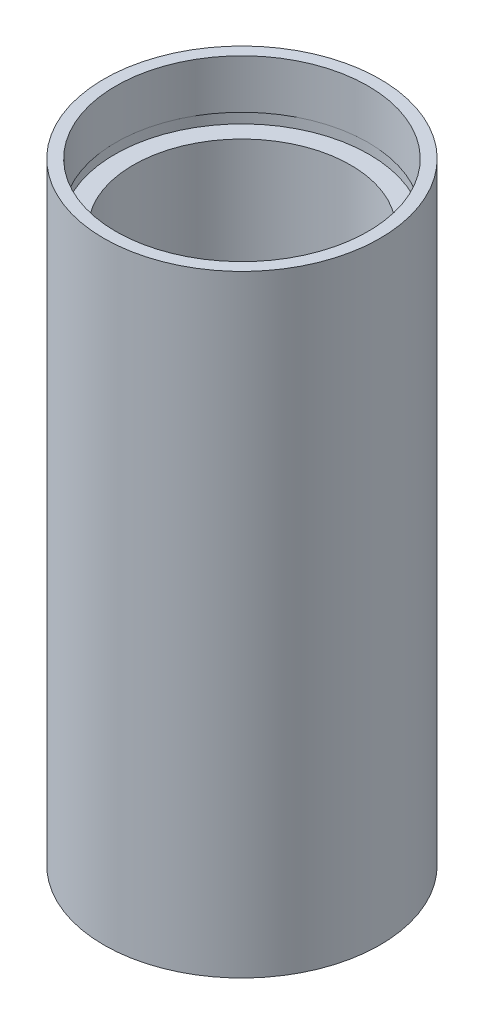
ISO-10303-21;
HEADER;
FILE_DESCRIPTION(('STEP AP214'),'2;1');
FILE_NAME('part.step','',(''),(''),'','','');
FILE_SCHEMA(('AUTOMOTIVE_DESIGN { 1 0 10303 214 1 1 1 1 }'));
ENDSEC;
DATA;
#1=APPLICATION_CONTEXT('core data for automotive mechanical design processes');
#2=APPLICATION_PROTOCOL_DEFINITION('international standard','automotive_design',2000,#1);
#3=PRODUCT_CONTEXT('',#1,'mechanical');
#4=PRODUCT('Part','Part','',(#3));
#5=PRODUCT_RELATED_PRODUCT_CATEGORY('part','',(#4));
#6=PRODUCT_DEFINITION_FORMATION('','',#4);
#7=PRODUCT_DEFINITION_CONTEXT('part definition',#1,'design');
#8=PRODUCT_DEFINITION('design','',#6,#7);
#9=PRODUCT_DEFINITION_SHAPE('','',#8);
#10=(LENGTH_UNIT() NAMED_UNIT(*) SI_UNIT(.MILLI.,.METRE.));
#11=(NAMED_UNIT(*) PLANE_ANGLE_UNIT() SI_UNIT($,.RADIAN.));
#12=(NAMED_UNIT(*) SI_UNIT($,.STERADIAN.) SOLID_ANGLE_UNIT());
#13=UNCERTAINTY_MEASURE_WITH_UNIT(LENGTH_MEASURE(1.E-05),#10,'distance_accuracy_value','');
#14=(GEOMETRIC_REPRESENTATION_CONTEXT(3) GLOBAL_UNCERTAINTY_ASSIGNED_CONTEXT((#13)) GLOBAL_UNIT_ASSIGNED_CONTEXT((#10,
#11,#12)) REPRESENTATION_CONTEXT('',''));
#15=CARTESIAN_POINT('',(0.,0.,0.));
#16=DIRECTION('',(0.,0.,1.));
#17=DIRECTION('',(1.,0.,0.));
#18=AXIS2_PLACEMENT_3D('',#15,#16,#17);
#19=CARTESIAN_POINT('',(11.1,0.,0.));
#20=DIRECTION('',(0.,1.,0.));
#21=DIRECTION('',(0.,0.,1.));
#22=AXIS2_PLACEMENT_3D('',#19,#20,#21);
#23=PLANE('',#22);
#24=CARTESIAN_POINT('',(0.,0.,0.));
#25=DIRECTION('',(0.,1.,0.));
#26=DIRECTION('',(0.,0.,1.));
#27=AXIS2_PLACEMENT_3D('',#24,#25,#26);
#28=CIRCLE('',#27,12.7);
#29=CARTESIAN_POINT('',(0.,0.,12.7));
#30=VERTEX_POINT('',#29);
#31=EDGE_CURVE('E10',#30,#30,#28,.T.);
#32=ORIENTED_EDGE('',*,*,#31,.F.);
#33=EDGE_LOOP('',(#32));
#34=FACE_BOUND('',#33,.T.);
#35=CARTESIAN_POINT('',(0.,0.,0.));
#36=DIRECTION('',(0.,1.,0.));
#37=DIRECTION('',(0.,0.,1.));
#38=AXIS2_PLACEMENT_3D('',#35,#36,#37);
#39=CIRCLE('',#38,11.1);
#40=CARTESIAN_POINT('',(0.,0.,11.1));
#41=VERTEX_POINT('',#40);
#42=EDGE_CURVE('E77',#41,#41,#39,.T.);
#43=ORIENTED_EDGE('',*,*,#42,.T.);
#44=EDGE_LOOP('',(#43));
#45=FACE_BOUND('',#44,.T.);
#46=ADVANCED_FACE('F37',(#34,#45),#23,.F.);
#47=CARTESIAN_POINT('',(0.,161.376166943427,0.));
#48=DIRECTION('',(0.,1.,0.));
#49=DIRECTION('',(0.,0.,1.));
#50=AXIS2_PLACEMENT_3D('',#47,#48,#49);
#51=CYLINDRICAL_SURFACE('',#50,12.7);
#52=CARTESIAN_POINT('',(0.,56.3,0.));
#53=DIRECTION('',(0.,1.,0.));
#54=DIRECTION('',(0.,0.,1.));
#55=AXIS2_PLACEMENT_3D('',#52,#53,#54);
#56=CIRCLE('',#55,12.7);
#57=CARTESIAN_POINT('',(0.,56.3,12.7));
#58=VERTEX_POINT('',#57);
#59=EDGE_CURVE('E43',#58,#58,#56,.T.);
#60=ORIENTED_EDGE('',*,*,#59,.F.);
#61=EDGE_LOOP('',(#60));
#62=FACE_BOUND('',#61,.T.);
#63=ORIENTED_EDGE('',*,*,#31,.T.);
#64=EDGE_LOOP('',(#63));
#65=FACE_BOUND('',#64,.T.);
#66=ADVANCED_FACE('F138',(#62,#65),#51,.T.);
#67=CARTESIAN_POINT('',(11.6,56.3,0.));
#68=DIRECTION('',(0.,-1.,0.));
#69=DIRECTION('',(0.,0.,-1.));
#70=AXIS2_PLACEMENT_3D('',#67,#68,#69);
#71=PLANE('',#70);
#72=CARTESIAN_POINT('',(0.,56.3,0.));
#73=DIRECTION('',(0.,1.,0.));
#74=DIRECTION('',(0.,0.,1.));
#75=AXIS2_PLACEMENT_3D('',#72,#73,#74);
#76=CIRCLE('',#75,11.6);
#77=CARTESIAN_POINT('',(0.,56.3,11.6));
#78=VERTEX_POINT('',#77);
#79=EDGE_CURVE('E47',#78,#78,#76,.T.);
#80=ORIENTED_EDGE('',*,*,#79,.F.);
#81=EDGE_LOOP('',(#80));
#82=FACE_BOUND('',#81,.T.);
#83=ORIENTED_EDGE('',*,*,#59,.T.);
#84=EDGE_LOOP('',(#83));
#85=FACE_BOUND('',#84,.T.);
#86=ADVANCED_FACE('F133',(#82,#85),#71,.F.);
#87=CARTESIAN_POINT('',(0.,161.376166943427,0.));
#88=DIRECTION('',(0.,1.,0.));
#89=DIRECTION('',(0.,0.,1.));
#90=AXIS2_PLACEMENT_3D('',#87,#88,#89);
#91=CYLINDRICAL_SURFACE('',#90,11.6);
#92=CARTESIAN_POINT('',(0.,51.8,0.));
#93=DIRECTION('',(0.,1.,0.));
#94=DIRECTION('',(0.,0.,1.));
#95=AXIS2_PLACEMENT_3D('',#92,#93,#94);
#96=CIRCLE('',#95,11.6);
#97=CARTESIAN_POINT('',(0.,51.8,11.6));
#98=VERTEX_POINT('',#97);
#99=EDGE_CURVE('E51',#98,#98,#96,.T.);
#100=ORIENTED_EDGE('',*,*,#99,.F.);
#101=EDGE_LOOP('',(#100));
#102=FACE_BOUND('',#101,.T.);
#103=ORIENTED_EDGE('',*,*,#79,.T.);
#104=EDGE_LOOP('',(#103));
#105=FACE_BOUND('',#104,.T.);
#106=ADVANCED_FACE('F127',(#102,#105),#91,.F.);
#107=CARTESIAN_POINT('',(11.6,51.8,0.));
#108=DIRECTION('',(0.,1.,0.));
#109=DIRECTION('',(0.,0.,1.));
#110=AXIS2_PLACEMENT_3D('',#107,#108,#109);
#111=PLANE('',#110);
#112=CARTESIAN_POINT('',(0.,51.8,0.));
#113=DIRECTION('',(0.,1.,0.));
#114=DIRECTION('',(0.,0.,1.));
#115=AXIS2_PLACEMENT_3D('',#112,#113,#114);
#116=CIRCLE('',#115,11.7);
#117=CARTESIAN_POINT('',(0.,51.8,11.7));
#118=VERTEX_POINT('',#117);
#119=EDGE_CURVE('E56',#118,#118,#116,.T.);
#120=ORIENTED_EDGE('',*,*,#119,.F.);
#121=EDGE_LOOP('',(#120));
#122=FACE_BOUND('',#121,.T.);
#123=ORIENTED_EDGE('',*,*,#99,.T.);
#124=EDGE_LOOP('',(#123));
#125=FACE_BOUND('',#124,.T.);
#126=ADVANCED_FACE('F121',(#122,#125),#111,.F.);
#127=CARTESIAN_POINT('',(0.,161.376166943427,0.));
#128=DIRECTION('',(0.,1.,0.));
#129=DIRECTION('',(0.,0.,1.));
#130=AXIS2_PLACEMENT_3D('',#127,#128,#129);
#131=CYLINDRICAL_SURFACE('',#130,11.7);
#132=CARTESIAN_POINT('',(0.,50.8,0.));
#133=DIRECTION('',(0.,1.,0.));
#134=DIRECTION('',(0.,0.,1.));
#135=AXIS2_PLACEMENT_3D('',#132,#133,#134);
#136=CIRCLE('',#135,11.7);
#137=CARTESIAN_POINT('',(0.,50.8,11.7));
#138=VERTEX_POINT('',#137);
#139=EDGE_CURVE('E59',#138,#138,#136,.T.);
#140=ORIENTED_EDGE('',*,*,#139,.F.);
#141=EDGE_LOOP('',(#140));
#142=FACE_BOUND('',#141,.T.);
#143=ORIENTED_EDGE('',*,*,#119,.T.);
#144=EDGE_LOOP('',(#143));
#145=FACE_BOUND('',#144,.T.);
#146=ADVANCED_FACE('F115',(#142,#145),#131,.F.);
#147=CARTESIAN_POINT('',(10.,50.8,0.));
#148=DIRECTION('',(0.,-1.,0.));
#149=DIRECTION('',(0.,0.,-1.));
#150=AXIS2_PLACEMENT_3D('',#147,#148,#149);
#151=PLANE('',#150);
#152=CARTESIAN_POINT('',(0.,50.8,0.));
#153=DIRECTION('',(0.,1.,0.));
#154=DIRECTION('',(0.,0.,1.));
#155=AXIS2_PLACEMENT_3D('',#152,#153,#154);
#156=CIRCLE('',#155,10.);
#157=CARTESIAN_POINT('',(0.,50.8,10.));
#158=VERTEX_POINT('',#157);
#159=EDGE_CURVE('E62',#158,#158,#156,.T.);
#160=ORIENTED_EDGE('',*,*,#159,.F.);
#161=EDGE_LOOP('',(#160));
#162=FACE_BOUND('',#161,.T.);
#163=ORIENTED_EDGE('',*,*,#139,.T.);
#164=EDGE_LOOP('',(#163));
#165=FACE_BOUND('',#164,.T.);
#166=ADVANCED_FACE('F109',(#162,#165),#151,.F.);
#167=CARTESIAN_POINT('',(0.,161.376166943427,0.));
#168=DIRECTION('',(0.,1.,0.));
#169=DIRECTION('',(0.,0.,1.));
#170=AXIS2_PLACEMENT_3D('',#167,#168,#169);
#171=CYLINDRICAL_SURFACE('',#170,10.);
#172=CARTESIAN_POINT('',(0.,5.49999999999998,0.));
#173=DIRECTION('',(0.,1.,0.));
#174=DIRECTION('',(0.,0.,1.));
#175=AXIS2_PLACEMENT_3D('',#172,#173,#174);
#176=CIRCLE('',#175,10.);
#177=CARTESIAN_POINT('',(0.,5.49999999999998,10.));
#178=VERTEX_POINT('',#177);
#179=EDGE_CURVE('E65',#178,#178,#176,.T.);
#180=ORIENTED_EDGE('',*,*,#179,.F.);
#181=EDGE_LOOP('',(#180));
#182=FACE_BOUND('',#181,.T.);
#183=ORIENTED_EDGE('',*,*,#159,.T.);
#184=EDGE_LOOP('',(#183));
#185=FACE_BOUND('',#184,.T.);
#186=ADVANCED_FACE('F103',(#182,#185),#171,.F.);
#187=CARTESIAN_POINT('',(11.7,5.49999999999998,0.));
#188=DIRECTION('',(0.,1.,0.));
#189=DIRECTION('',(0.,0.,1.));
#190=AXIS2_PLACEMENT_3D('',#187,#188,#189);
#191=PLANE('',#190);
#192=CARTESIAN_POINT('',(0.,5.49999999999998,0.));
#193=DIRECTION('',(0.,1.,0.));
#194=DIRECTION('',(0.,0.,1.));
#195=AXIS2_PLACEMENT_3D('',#192,#193,#194);
#196=CIRCLE('',#195,11.7);
#197=CARTESIAN_POINT('',(0.,5.49999999999998,11.7));
#198=VERTEX_POINT('',#197);
#199=EDGE_CURVE('E68',#198,#198,#196,.T.);
#200=ORIENTED_EDGE('',*,*,#199,.F.);
#201=EDGE_LOOP('',(#200));
#202=FACE_BOUND('',#201,.T.);
#203=ORIENTED_EDGE('',*,*,#179,.T.);
#204=EDGE_LOOP('',(#203));
#205=FACE_BOUND('',#204,.T.);
#206=ADVANCED_FACE('F97',(#202,#205),#191,.F.);
#207=CARTESIAN_POINT('',(0.,161.376166943427,0.));
#208=DIRECTION('',(0.,1.,0.));
#209=DIRECTION('',(0.,0.,1.));
#210=AXIS2_PLACEMENT_3D('',#207,#208,#209);
#211=CYLINDRICAL_SURFACE('',#210,11.7);
#212=CARTESIAN_POINT('',(0.,4.49999999999998,0.));
#213=DIRECTION('',(0.,1.,0.));
#214=DIRECTION('',(0.,0.,1.));
#215=AXIS2_PLACEMENT_3D('',#212,#213,#214);
#216=CIRCLE('',#215,11.7);
#217=CARTESIAN_POINT('',(0.,4.49999999999998,11.7));
#218=VERTEX_POINT('',#217);
#219=EDGE_CURVE('E71',#218,#218,#216,.T.);
#220=ORIENTED_EDGE('',*,*,#219,.F.);
#221=EDGE_LOOP('',(#220));
#222=FACE_BOUND('',#221,.T.);
#223=ORIENTED_EDGE('',*,*,#199,.T.);
#224=EDGE_LOOP('',(#223));
#225=FACE_BOUND('',#224,.T.);
#226=ADVANCED_FACE('F91',(#222,#225),#211,.F.);
#227=CARTESIAN_POINT('',(11.1,4.49999999999998,0.));
#228=DIRECTION('',(0.,-1.,0.));
#229=DIRECTION('',(0.,0.,-1.));
#230=AXIS2_PLACEMENT_3D('',#227,#228,#229);
#231=PLANE('',#230);
#232=CARTESIAN_POINT('',(0.,4.49999999999998,0.));
#233=DIRECTION('',(0.,1.,0.));
#234=DIRECTION('',(0.,0.,1.));
#235=AXIS2_PLACEMENT_3D('',#232,#233,#234);
#236=CIRCLE('',#235,11.1);
#237=CARTESIAN_POINT('',(0.,4.49999999999998,11.1));
#238=VERTEX_POINT('',#237);
#239=EDGE_CURVE('E74',#238,#238,#236,.T.);
#240=ORIENTED_EDGE('',*,*,#239,.F.);
#241=EDGE_LOOP('',(#240));
#242=FACE_BOUND('',#241,.T.);
#243=ORIENTED_EDGE('',*,*,#219,.T.);
#244=EDGE_LOOP('',(#243));
#245=FACE_BOUND('',#244,.T.);
#246=ADVANCED_FACE('F85',(#242,#245),#231,.F.);
#247=CARTESIAN_POINT('',(0.,161.376166943427,0.));
#248=DIRECTION('',(0.,1.,0.));
#249=DIRECTION('',(0.,0.,1.));
#250=AXIS2_PLACEMENT_3D('',#247,#248,#249);
#251=CYLINDRICAL_SURFACE('',#250,11.1);
#252=ORIENTED_EDGE('',*,*,#42,.F.);
#253=EDGE_LOOP('',(#252));
#254=FACE_BOUND('',#253,.T.);
#255=ORIENTED_EDGE('',*,*,#239,.T.);
#256=EDGE_LOOP('',(#255));
#257=FACE_BOUND('',#256,.T.);
#258=ADVANCED_FACE('F82',(#254,#257),#251,.F.);
#259=CLOSED_SHELL('',(#46,#66,#86,#106,#126,#146,#166,#186,#206,#226,#246,#258));
#260=MANIFOLD_SOLID_BREP('B2',#259);
#261=ADVANCED_BREP_SHAPE_REPRESENTATION('',(#18,#260),#14);
#262=SHAPE_DEFINITION_REPRESENTATION(#9,#261);
ENDSEC;
END-ISO-10303-21;
